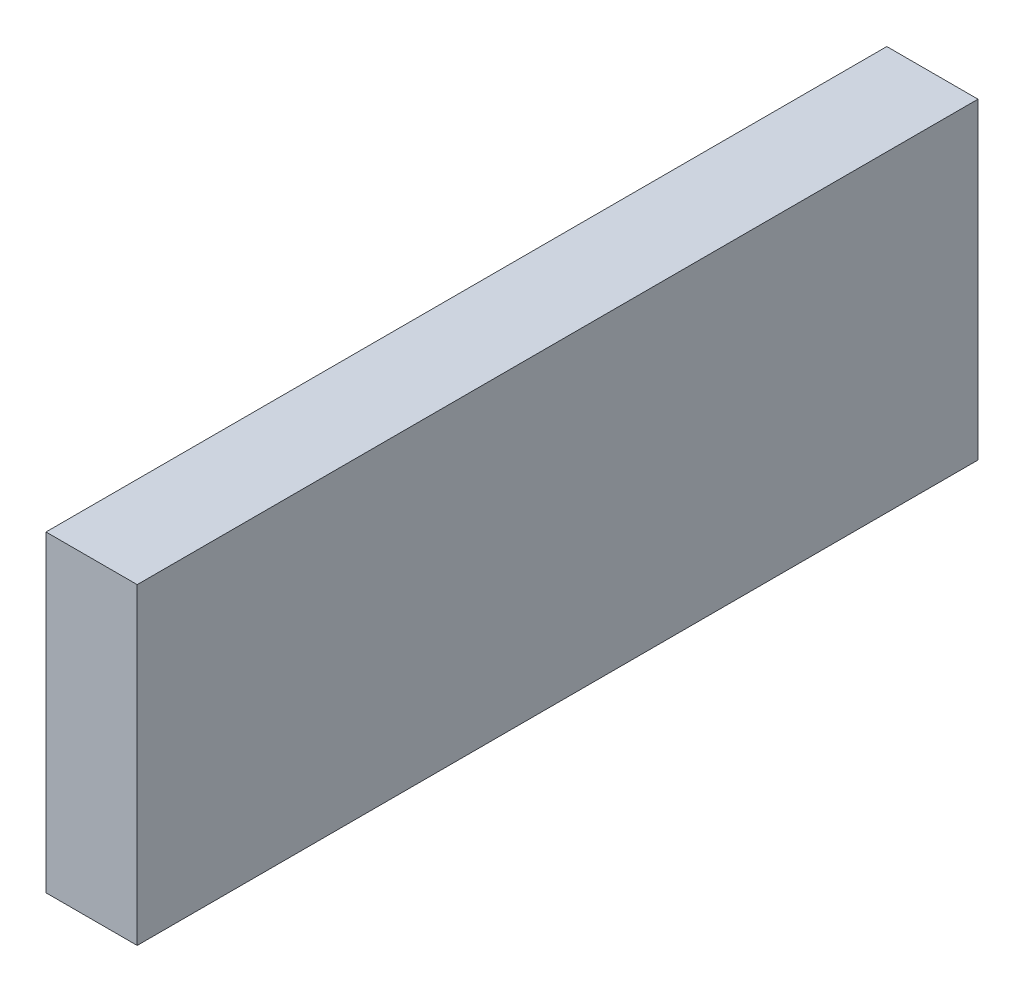
ISO-10303-21;
HEADER;
FILE_DESCRIPTION(('STEP AP214'),'2;1');
FILE_NAME('part.step','',(''),(''),'','','');
FILE_SCHEMA(('AUTOMOTIVE_DESIGN { 1 0 10303 214 1 1 1 1 }'));
ENDSEC;
DATA;
#1=APPLICATION_CONTEXT('core data for automotive mechanical design processes');
#2=APPLICATION_PROTOCOL_DEFINITION('international standard','automotive_design',2000,#1);
#3=PRODUCT_CONTEXT('',#1,'mechanical');
#4=PRODUCT('Part','Part','',(#3));
#5=PRODUCT_RELATED_PRODUCT_CATEGORY('part','',(#4));
#6=PRODUCT_DEFINITION_FORMATION('','',#4);
#7=PRODUCT_DEFINITION_CONTEXT('part definition',#1,'design');
#8=PRODUCT_DEFINITION('design','',#6,#7);
#9=PRODUCT_DEFINITION_SHAPE('','',#8);
#10=(LENGTH_UNIT() NAMED_UNIT(*) SI_UNIT(.MILLI.,.METRE.));
#11=(NAMED_UNIT(*) PLANE_ANGLE_UNIT() SI_UNIT($,.RADIAN.));
#12=(NAMED_UNIT(*) SI_UNIT($,.STERADIAN.) SOLID_ANGLE_UNIT());
#13=UNCERTAINTY_MEASURE_WITH_UNIT(LENGTH_MEASURE(1.E-05),#10,'distance_accuracy_value','');
#14=(GEOMETRIC_REPRESENTATION_CONTEXT(3) GLOBAL_UNCERTAINTY_ASSIGNED_CONTEXT((#13)) GLOBAL_UNIT_ASSIGNED_CONTEXT((#10,
#11,#12)) REPRESENTATION_CONTEXT('',''));
#15=CARTESIAN_POINT('',(0.,0.,0.));
#16=DIRECTION('',(0.,0.,1.));
#17=DIRECTION('',(1.,0.,0.));
#18=AXIS2_PLACEMENT_3D('',#15,#16,#17);
#19=CARTESIAN_POINT('',(5.,0.,-46.1004877198273));
#20=DIRECTION('',(0.,0.,1.));
#21=DIRECTION('',(1.,0.,0.));
#22=AXIS2_PLACEMENT_3D('',#19,#20,#21);
#23=PLANE('',#22);
#24=DIRECTION('',(0.,1.,0.));
#25=VECTOR('',#24,1.);
#26=CARTESIAN_POINT('',(0.,0.,-46.1004877198273));
#27=LINE('',#26,#25);
#28=CARTESIAN_POINT('',(0.,0.,-46.1004877198273));
#29=VERTEX_POINT('',#28);
#30=CARTESIAN_POINT('',(0.,17.1346945507323,-46.1004877198273));
#31=VERTEX_POINT('',#30);
#32=EDGE_CURVE('E187',#29,#31,#27,.T.);
#33=ORIENTED_EDGE('',*,*,#32,.T.);
#34=DIRECTION('',(-1.,0.,0.));
#35=VECTOR('',#34,1.);
#36=CARTESIAN_POINT('',(5.,17.1346945507323,-46.1004877198273));
#37=LINE('',#36,#35);
#38=CARTESIAN_POINT('',(5.,17.1346945507323,-46.1004877198273));
#39=VERTEX_POINT('',#38);
#40=EDGE_CURVE('E194',#39,#31,#37,.T.);
#41=ORIENTED_EDGE('',*,*,#40,.F.);
#42=DIRECTION('',(0.,1.,0.));
#43=VECTOR('',#42,1.);
#44=CARTESIAN_POINT('',(5.,0.,-46.1004877198273));
#45=LINE('',#44,#43);
#46=CARTESIAN_POINT('',(5.,0.,-46.1004877198273));
#47=VERTEX_POINT('',#46);
#48=EDGE_CURVE('E175',#47,#39,#45,.T.);
#49=ORIENTED_EDGE('',*,*,#48,.F.);
#50=DIRECTION('',(-1.,0.,0.));
#51=VECTOR('',#50,1.);
#52=CARTESIAN_POINT('',(5.,0.,-46.1004877198273));
#53=LINE('',#52,#51);
#54=EDGE_CURVE('E50',#47,#29,#53,.T.);
#55=ORIENTED_EDGE('',*,*,#54,.T.);
#56=EDGE_LOOP('',(#33,#41,#49,#55));
#57=FACE_BOUND('',#56,.T.);
#58=DIRECTION('',(0.,1.,0.));
#59=VECTOR('',#58,1.);
#60=CARTESIAN_POINT('',(0.5,0.,-46.1004877198273));
#61=LINE('',#60,#59);
#62=CARTESIAN_POINT('',(0.5,0.5,-46.1004877198273));
#63=VERTEX_POINT('',#62);
#64=CARTESIAN_POINT('',(0.5,16.6346945507323,-46.1004877198273));
#65=VERTEX_POINT('',#64);
#66=EDGE_CURVE('E127',#63,#65,#61,.T.);
#67=ORIENTED_EDGE('',*,*,#66,.F.);
#68=DIRECTION('',(-1.,0.,0.));
#69=VECTOR('',#68,1.);
#70=CARTESIAN_POINT('',(5.,0.5,-46.1004877198273));
#71=LINE('',#70,#69);
#72=CARTESIAN_POINT('',(4.5,0.5,-46.1004877198273));
#73=VERTEX_POINT('',#72);
#74=EDGE_CURVE('E122',#73,#63,#71,.T.);
#75=ORIENTED_EDGE('',*,*,#74,.F.);
#76=DIRECTION('',(0.,1.,0.));
#77=VECTOR('',#76,1.);
#78=CARTESIAN_POINT('',(4.5,0.,-46.1004877198273));
#79=LINE('',#78,#77);
#80=CARTESIAN_POINT('',(4.5,16.6346945507323,-46.1004877198273));
#81=VERTEX_POINT('',#80);
#82=EDGE_CURVE('E57',#73,#81,#79,.T.);
#83=ORIENTED_EDGE('',*,*,#82,.T.);
#84=DIRECTION('',(-1.,0.,0.));
#85=VECTOR('',#84,1.);
#86=CARTESIAN_POINT('',(5.,16.6346945507323,-46.1004877198273));
#87=LINE('',#86,#85);
#88=EDGE_CURVE('E152',#81,#65,#87,.T.);
#89=ORIENTED_EDGE('',*,*,#88,.T.);
#90=EDGE_LOOP('',(#67,#75,#83,#89));
#91=FACE_BOUND('',#90,.T.);
#92=ADVANCED_FACE('F41',(#57,#91),#23,.F.);
#93=CARTESIAN_POINT('',(5.,0.,0.));
#94=DIRECTION('',(0.,0.,-1.));
#95=DIRECTION('',(-1.,0.,0.));
#96=AXIS2_PLACEMENT_3D('',#93,#94,#95);
#97=PLANE('',#96);
#98=DIRECTION('',(0.,-1.,0.));
#99=VECTOR('',#98,1.);
#100=CARTESIAN_POINT('',(0.,0.,0.));
#101=LINE('',#100,#99);
#102=CARTESIAN_POINT('',(0.,17.1346945507323,0.));
#103=VERTEX_POINT('',#102);
#104=CARTESIAN_POINT('',(0.,0.,0.));
#105=VERTEX_POINT('',#104);
#106=EDGE_CURVE('E138',#103,#105,#101,.T.);
#107=ORIENTED_EDGE('',*,*,#106,.T.);
#108=DIRECTION('',(-1.,0.,0.));
#109=VECTOR('',#108,1.);
#110=CARTESIAN_POINT('',(5.,0.,0.));
#111=LINE('',#110,#109);
#112=CARTESIAN_POINT('',(5.,0.,0.));
#113=VERTEX_POINT('',#112);
#114=EDGE_CURVE('E11',#113,#105,#111,.T.);
#115=ORIENTED_EDGE('',*,*,#114,.F.);
#116=DIRECTION('',(0.,-1.,0.));
#117=VECTOR('',#116,1.);
#118=CARTESIAN_POINT('',(5.,0.,0.));
#119=LINE('',#118,#117);
#120=CARTESIAN_POINT('',(5.,17.1346945507323,0.));
#121=VERTEX_POINT('',#120);
#122=EDGE_CURVE('E170',#121,#113,#119,.T.);
#123=ORIENTED_EDGE('',*,*,#122,.F.);
#124=DIRECTION('',(-1.,0.,0.));
#125=VECTOR('',#124,1.);
#126=CARTESIAN_POINT('',(5.,17.1346945507323,0.));
#127=LINE('',#126,#125);
#128=EDGE_CURVE('E180',#121,#103,#127,.T.);
#129=ORIENTED_EDGE('',*,*,#128,.T.);
#130=EDGE_LOOP('',(#107,#115,#123,#129));
#131=FACE_BOUND('',#130,.T.);
#132=ADVANCED_FACE('F43',(#131),#97,.F.);
#133=CARTESIAN_POINT('',(5.,0.,0.));
#134=DIRECTION('',(0.,1.,0.));
#135=DIRECTION('',(0.,0.,1.));
#136=AXIS2_PLACEMENT_3D('',#133,#134,#135);
#137=PLANE('',#136);
#138=DIRECTION('',(0.,0.,-1.));
#139=VECTOR('',#138,1.);
#140=CARTESIAN_POINT('',(0.,0.,0.));
#141=LINE('',#140,#139);
#142=EDGE_CURVE('E184',#105,#29,#141,.T.);
#143=ORIENTED_EDGE('',*,*,#142,.T.);
#144=ORIENTED_EDGE('',*,*,#54,.F.);
#145=DIRECTION('',(0.,0.,-1.));
#146=VECTOR('',#145,1.);
#147=CARTESIAN_POINT('',(5.,0.,0.));
#148=LINE('',#147,#146);
#149=EDGE_CURVE('E94',#113,#47,#148,.T.);
#150=ORIENTED_EDGE('',*,*,#149,.F.);
#151=ORIENTED_EDGE('',*,*,#114,.T.);
#152=EDGE_LOOP('',(#143,#144,#150,#151));
#153=FACE_BOUND('',#152,.T.);
#154=ADVANCED_FACE('F212',(#153),#137,.F.);
#155=CARTESIAN_POINT('',(5.,17.1346945507323,0.));
#156=DIRECTION('',(0.,-1.,0.));
#157=DIRECTION('',(0.,0.,-1.));
#158=AXIS2_PLACEMENT_3D('',#155,#156,#157);
#159=PLANE('',#158);
#160=DIRECTION('',(0.,0.,1.));
#161=VECTOR('',#160,1.);
#162=CARTESIAN_POINT('',(0.,17.1346945507323,0.));
#163=LINE('',#162,#161);
#164=EDGE_CURVE('E87',#31,#103,#163,.T.);
#165=ORIENTED_EDGE('',*,*,#164,.T.);
#166=ORIENTED_EDGE('',*,*,#128,.F.);
#167=DIRECTION('',(0.,0.,1.));
#168=VECTOR('',#167,1.);
#169=CARTESIAN_POINT('',(5.,17.1346945507323,0.));
#170=LINE('',#169,#168);
#171=EDGE_CURVE('E66',#39,#121,#170,.T.);
#172=ORIENTED_EDGE('',*,*,#171,.F.);
#173=ORIENTED_EDGE('',*,*,#40,.T.);
#174=EDGE_LOOP('',(#165,#166,#172,#173));
#175=FACE_BOUND('',#174,.T.);
#176=ADVANCED_FACE('F209',(#175),#159,.F.);
#177=CARTESIAN_POINT('',(5.,0.,0.));
#178=DIRECTION('',(-1.,0.,0.));
#179=DIRECTION('',(0.,0.,1.));
#180=AXIS2_PLACEMENT_3D('',#177,#178,#179);
#181=PLANE('',#180);
#182=ORIENTED_EDGE('',*,*,#122,.T.);
#183=ORIENTED_EDGE('',*,*,#149,.T.);
#184=ORIENTED_EDGE('',*,*,#48,.T.);
#185=ORIENTED_EDGE('',*,*,#171,.T.);
#186=EDGE_LOOP('',(#182,#183,#184,#185));
#187=FACE_BOUND('',#186,.T.);
#188=ADVANCED_FACE('F211',(#187),#181,.F.);
#189=CARTESIAN_POINT('',(0.,0.,0.));
#190=DIRECTION('',(-1.,0.,0.));
#191=DIRECTION('',(0.,0.,1.));
#192=AXIS2_PLACEMENT_3D('',#189,#190,#191);
#193=PLANE('',#192);
#194=ORIENTED_EDGE('',*,*,#106,.F.);
#195=ORIENTED_EDGE('',*,*,#164,.F.);
#196=ORIENTED_EDGE('',*,*,#32,.F.);
#197=ORIENTED_EDGE('',*,*,#142,.F.);
#198=EDGE_LOOP('',(#194,#195,#196,#197));
#199=FACE_BOUND('',#198,.T.);
#200=ADVANCED_FACE('F205',(#199),#193,.T.);
#201=CARTESIAN_POINT('',(5.,0.,-0.5));
#202=DIRECTION('',(0.,0.,-1.));
#203=DIRECTION('',(-1.,0.,0.));
#204=AXIS2_PLACEMENT_3D('',#201,#202,#203);
#205=PLANE('',#204);
#206=DIRECTION('',(0.,-1.,0.));
#207=VECTOR('',#206,1.);
#208=CARTESIAN_POINT('',(0.5,0.,-0.5));
#209=LINE('',#208,#207);
#210=CARTESIAN_POINT('',(0.5,16.6346945507323,-0.5));
#211=VERTEX_POINT('',#210);
#212=CARTESIAN_POINT('',(0.5,0.5,-0.5));
#213=VERTEX_POINT('',#212);
#214=EDGE_CURVE('E128',#211,#213,#209,.T.);
#215=ORIENTED_EDGE('',*,*,#214,.F.);
#216=DIRECTION('',(-1.,0.,0.));
#217=VECTOR('',#216,1.);
#218=CARTESIAN_POINT('',(5.,16.6346945507323,-0.5));
#219=LINE('',#218,#217);
#220=CARTESIAN_POINT('',(4.5,16.6346945507323,-0.5));
#221=VERTEX_POINT('',#220);
#222=EDGE_CURVE('E150',#221,#211,#219,.T.);
#223=ORIENTED_EDGE('',*,*,#222,.F.);
#224=DIRECTION('',(0.,-1.,0.));
#225=VECTOR('',#224,1.);
#226=CARTESIAN_POINT('',(4.5,0.,-0.5));
#227=LINE('',#226,#225);
#228=CARTESIAN_POINT('',(4.5,0.5,-0.5));
#229=VERTEX_POINT('',#228);
#230=EDGE_CURVE('E136',#221,#229,#227,.T.);
#231=ORIENTED_EDGE('',*,*,#230,.T.);
#232=DIRECTION('',(-1.,0.,0.));
#233=VECTOR('',#232,1.);
#234=CARTESIAN_POINT('',(5.,0.5,-0.5));
#235=LINE('',#234,#233);
#236=EDGE_CURVE('E120',#229,#213,#235,.T.);
#237=ORIENTED_EDGE('',*,*,#236,.T.);
#238=EDGE_LOOP('',(#215,#223,#231,#237));
#239=FACE_BOUND('',#238,.T.);
#240=ADVANCED_FACE('F133',(#239),#205,.T.);
#241=CARTESIAN_POINT('',(5.,0.5,0.));
#242=DIRECTION('',(0.,1.,0.));
#243=DIRECTION('',(0.,0.,1.));
#244=AXIS2_PLACEMENT_3D('',#241,#242,#243);
#245=PLANE('',#244);
#246=DIRECTION('',(0.,0.,-1.));
#247=VECTOR('',#246,1.);
#248=CARTESIAN_POINT('',(0.5,0.5,0.));
#249=LINE('',#248,#247);
#250=EDGE_CURVE('E117',#213,#63,#249,.T.);
#251=ORIENTED_EDGE('',*,*,#250,.F.);
#252=ORIENTED_EDGE('',*,*,#236,.F.);
#253=DIRECTION('',(0.,0.,-1.));
#254=VECTOR('',#253,1.);
#255=CARTESIAN_POINT('',(4.5,0.5,0.));
#256=LINE('',#255,#254);
#257=EDGE_CURVE('E149',#229,#73,#256,.T.);
#258=ORIENTED_EDGE('',*,*,#257,.T.);
#259=ORIENTED_EDGE('',*,*,#74,.T.);
#260=EDGE_LOOP('',(#251,#252,#258,#259));
#261=FACE_BOUND('',#260,.T.);
#262=ADVANCED_FACE('F119',(#261),#245,.T.);
#263=CARTESIAN_POINT('',(5.,16.6346945507323,0.));
#264=DIRECTION('',(0.,-1.,0.));
#265=DIRECTION('',(0.,0.,-1.));
#266=AXIS2_PLACEMENT_3D('',#263,#264,#265);
#267=PLANE('',#266);
#268=DIRECTION('',(0.,0.,1.));
#269=VECTOR('',#268,1.);
#270=CARTESIAN_POINT('',(0.5,16.6346945507323,0.));
#271=LINE('',#270,#269);
#272=EDGE_CURVE('E142',#65,#211,#271,.T.);
#273=ORIENTED_EDGE('',*,*,#272,.F.);
#274=ORIENTED_EDGE('',*,*,#88,.F.);
#275=DIRECTION('',(0.,0.,1.));
#276=VECTOR('',#275,1.);
#277=CARTESIAN_POINT('',(4.5,16.6346945507323,0.));
#278=LINE('',#277,#276);
#279=EDGE_CURVE('E153',#81,#221,#278,.T.);
#280=ORIENTED_EDGE('',*,*,#279,.T.);
#281=ORIENTED_EDGE('',*,*,#222,.T.);
#282=EDGE_LOOP('',(#273,#274,#280,#281));
#283=FACE_BOUND('',#282,.T.);
#284=ADVANCED_FACE('F289',(#283),#267,.T.);
#285=CARTESIAN_POINT('',(4.5,0.,0.));
#286=DIRECTION('',(-1.,0.,0.));
#287=DIRECTION('',(0.,0.,1.));
#288=AXIS2_PLACEMENT_3D('',#285,#286,#287);
#289=PLANE('',#288);
#290=ORIENTED_EDGE('',*,*,#230,.F.);
#291=ORIENTED_EDGE('',*,*,#279,.F.);
#292=ORIENTED_EDGE('',*,*,#82,.F.);
#293=ORIENTED_EDGE('',*,*,#257,.F.);
#294=EDGE_LOOP('',(#290,#291,#292,#293));
#295=FACE_BOUND('',#294,.T.);
#296=ADVANCED_FACE('F298',(#295),#289,.T.);
#297=CARTESIAN_POINT('',(0.5,0.,0.));
#298=DIRECTION('',(-1.,0.,0.));
#299=DIRECTION('',(0.,0.,1.));
#300=AXIS2_PLACEMENT_3D('',#297,#298,#299);
#301=PLANE('',#300);
#302=ORIENTED_EDGE('',*,*,#214,.T.);
#303=ORIENTED_EDGE('',*,*,#250,.T.);
#304=ORIENTED_EDGE('',*,*,#66,.T.);
#305=ORIENTED_EDGE('',*,*,#272,.T.);
#306=EDGE_LOOP('',(#302,#303,#304,#305));
#307=FACE_BOUND('',#306,.T.);
#308=ADVANCED_FACE('F140',(#307),#301,.F.);
#309=CLOSED_SHELL('',(#92,#132,#154,#176,#188,#200,#240,#262,#284,#296,#308));
#310=MANIFOLD_SOLID_BREP('B2',#309);
#311=ADVANCED_BREP_SHAPE_REPRESENTATION('',(#18,#310),#14);
#312=SHAPE_DEFINITION_REPRESENTATION(#9,#311);
ENDSEC;
END-ISO-10303-21;
